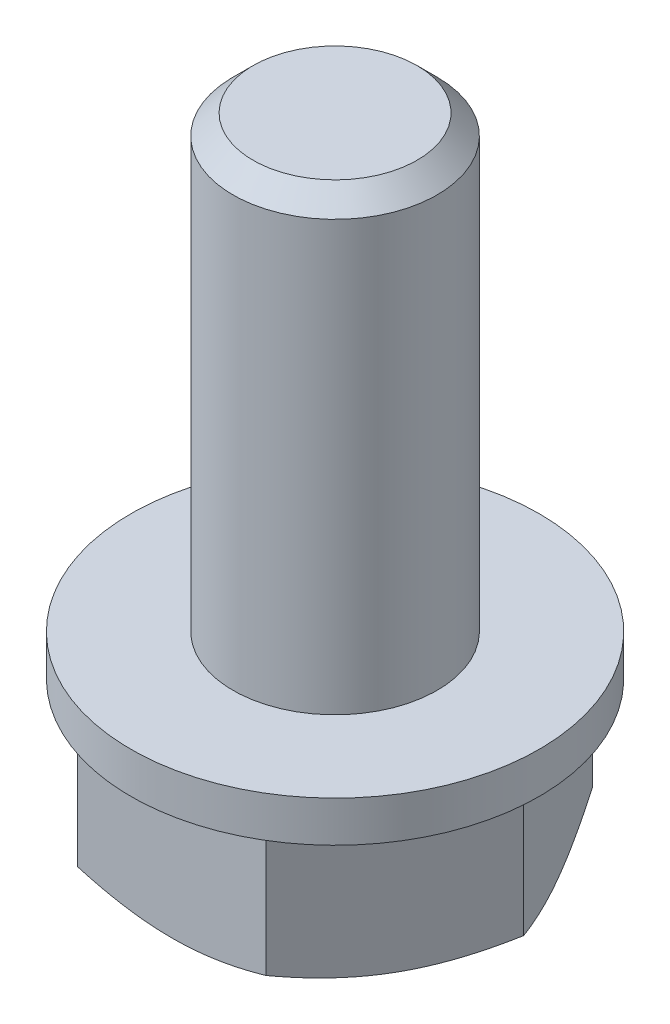
ISO-10303-21;
HEADER;
FILE_DESCRIPTION(('STEP AP214'),'2;1');
FILE_NAME('part.step','',(''),(''),'','','');
FILE_SCHEMA(('AUTOMOTIVE_DESIGN { 1 0 10303 214 1 1 1 1 }'));
ENDSEC;
DATA;
#1=APPLICATION_CONTEXT('core data for automotive mechanical design processes');
#2=APPLICATION_PROTOCOL_DEFINITION('international standard','automotive_design',2000,#1);
#3=PRODUCT_CONTEXT('',#1,'mechanical');
#4=PRODUCT('Part','Part','',(#3));
#5=PRODUCT_RELATED_PRODUCT_CATEGORY('part','',(#4));
#6=PRODUCT_DEFINITION_FORMATION('','',#4);
#7=PRODUCT_DEFINITION_CONTEXT('part definition',#1,'design');
#8=PRODUCT_DEFINITION('design','',#6,#7);
#9=PRODUCT_DEFINITION_SHAPE('','',#8);
#10=(LENGTH_UNIT() NAMED_UNIT(*) SI_UNIT(.MILLI.,.METRE.));
#11=(NAMED_UNIT(*) PLANE_ANGLE_UNIT() SI_UNIT($,.RADIAN.));
#12=(NAMED_UNIT(*) SI_UNIT($,.STERADIAN.) SOLID_ANGLE_UNIT());
#13=UNCERTAINTY_MEASURE_WITH_UNIT(LENGTH_MEASURE(1.E-05),#10,'distance_accuracy_value','');
#14=(GEOMETRIC_REPRESENTATION_CONTEXT(3) GLOBAL_UNCERTAINTY_ASSIGNED_CONTEXT((#13)) GLOBAL_UNIT_ASSIGNED_CONTEXT((#10,
#11,#12)) REPRESENTATION_CONTEXT('',''));
#15=CARTESIAN_POINT('',(0.,0.,0.));
#16=DIRECTION('',(0.,0.,1.));
#17=DIRECTION('',(1.,0.,0.));
#18=AXIS2_PLACEMENT_3D('',#15,#16,#17);
#19=CARTESIAN_POINT('',(-12.374368670765,-45.18,-14.374368670765));
#20=DIRECTION('',(0.,-1.,0.));
#21=DIRECTION('',(0.,0.,-1.));
#22=AXIS2_PLACEMENT_3D('',#19,#20,#21);
#23=PLANE('',#22);
#24=CARTESIAN_POINT('',(-12.374368670765,-45.18,-12.374368670765));
#25=DIRECTION('',(0.,-1.,0.));
#26=DIRECTION('',(0.,0.,-1.));
#27=AXIS2_PLACEMENT_3D('',#24,#25,#26);
#28=CIRCLE('',#27,4.);
#29=CARTESIAN_POINT('',(-12.374368670765,-45.18,-16.374368670765));
#30=VERTEX_POINT('',#29);
#31=CARTESIAN_POINT('',(-8.91026705562725,-45.18,-14.374368670765));
#32=VERTEX_POINT('',#31);
#33=EDGE_CURVE('E164',#30,#32,#28,.T.);
#34=ORIENTED_EDGE('',*,*,#33,.T.);
#35=CARTESIAN_POINT('',(-12.374368670765,-45.18,-12.374368670765));
#36=DIRECTION('',(0.,-1.,0.));
#37=DIRECTION('',(0.,0.,-1.));
#38=AXIS2_PLACEMENT_3D('',#35,#36,#37);
#39=CIRCLE('',#38,4.);
#40=CARTESIAN_POINT('',(-8.91026705562725,-45.18,-10.374368670765));
#41=VERTEX_POINT('',#40);
#42=EDGE_CURVE('E167',#32,#41,#39,.T.);
#43=ORIENTED_EDGE('',*,*,#42,.T.);
#44=CARTESIAN_POINT('',(-12.374368670765,-45.18,-12.374368670765));
#45=DIRECTION('',(0.,-1.,0.));
#46=DIRECTION('',(0.,0.,-1.));
#47=AXIS2_PLACEMENT_3D('',#44,#45,#46);
#48=CIRCLE('',#47,4.);
#49=CARTESIAN_POINT('',(-12.374368670765,-45.18,-8.374368670765));
#50=VERTEX_POINT('',#49);
#51=EDGE_CURVE('E110',#41,#50,#48,.T.);
#52=ORIENTED_EDGE('',*,*,#51,.T.);
#53=CARTESIAN_POINT('',(-12.374368670765,-45.18,-12.374368670765));
#54=DIRECTION('',(0.,-1.,0.));
#55=DIRECTION('',(0.,0.,-1.));
#56=AXIS2_PLACEMENT_3D('',#53,#54,#55);
#57=CIRCLE('',#56,4.);
#58=CARTESIAN_POINT('',(-15.8384702859027,-45.18,-10.374368670765));
#59=VERTEX_POINT('',#58);
#60=EDGE_CURVE('E20',#50,#59,#57,.T.);
#61=ORIENTED_EDGE('',*,*,#60,.T.);
#62=CARTESIAN_POINT('',(-12.374368670765,-45.18,-12.374368670765));
#63=DIRECTION('',(0.,-1.,0.));
#64=DIRECTION('',(0.,0.,-1.));
#65=AXIS2_PLACEMENT_3D('',#62,#63,#64);
#66=CIRCLE('',#65,4.);
#67=CARTESIAN_POINT('',(-15.8384702859027,-45.18,-14.374368670765));
#68=VERTEX_POINT('',#67);
#69=EDGE_CURVE('E127',#59,#68,#66,.T.);
#70=ORIENTED_EDGE('',*,*,#69,.T.);
#71=CARTESIAN_POINT('',(-12.374368670765,-45.18,-12.374368670765));
#72=DIRECTION('',(0.,-1.,0.));
#73=DIRECTION('',(0.,0.,-1.));
#74=AXIS2_PLACEMENT_3D('',#71,#72,#73);
#75=CIRCLE('',#74,4.);
#76=EDGE_CURVE('E75',#68,#30,#75,.T.);
#77=ORIENTED_EDGE('',*,*,#76,.T.);
#78=EDGE_LOOP('',(#34,#43,#52,#61,#70,#77));
#79=FACE_BOUND('',#78,.T.);
#80=ADVANCED_FACE('F16',(#79),#23,.T.);
#81=CARTESIAN_POINT('',(-12.374368670765,-42.6413248654052,-12.374368670765));
#82=DIRECTION('',(0.,1.,0.));
#83=DIRECTION('',(0.,0.,-1.));
#84=AXIS2_PLACEMENT_3D('',#81,#82,#83);
#85=CYLINDRICAL_SURFACE('',#84,5.);
#86=CARTESIAN_POINT('',(-12.374368670765,-40.68,-12.374368670765));
#87=DIRECTION('',(0.,-1.,0.));
#88=DIRECTION('',(0.,0.,-1.));
#89=AXIS2_PLACEMENT_3D('',#86,#87,#88);
#90=CIRCLE('',#89,5.);
#91=CARTESIAN_POINT('',(-12.374368670765,-40.68,-17.374368670765));
#92=VERTEX_POINT('',#91);
#93=EDGE_CURVE('E11',#92,#92,#90,.T.);
#94=ORIENTED_EDGE('',*,*,#93,.T.);
#95=EDGE_LOOP('',(#94));
#96=FACE_BOUND('',#95,.T.);
#97=CARTESIAN_POINT('',(-12.374368670765,-41.68,-12.374368670765));
#98=DIRECTION('',(0.,1.,0.));
#99=DIRECTION('',(0.,0.,-1.));
#100=AXIS2_PLACEMENT_3D('',#97,#98,#99);
#101=CIRCLE('',#100,5.);
#102=CARTESIAN_POINT('',(-12.374368670765,-41.68,-17.374368670765));
#103=VERTEX_POINT('',#102);
#104=EDGE_CURVE('E124',#103,#103,#101,.T.);
#105=ORIENTED_EDGE('',*,*,#104,.T.);
#106=EDGE_LOOP('',(#105));
#107=FACE_BOUND('',#106,.T.);
#108=ADVANCED_FACE('F125',(#96,#107),#85,.T.);
#109=CARTESIAN_POINT('',(-12.374368670765,-40.68,-16.124368670765));
#110=DIRECTION('',(0.,1.,0.));
#111=DIRECTION('',(0.,0.,1.));
#112=AXIS2_PLACEMENT_3D('',#109,#110,#111);
#113=PLANE('',#112);
#114=CARTESIAN_POINT('',(-12.374368670765,-40.68,-12.374368670765));
#115=DIRECTION('',(0.,-1.,0.));
#116=DIRECTION('',(0.,0.,-1.));
#117=AXIS2_PLACEMENT_3D('',#114,#115,#116);
#118=CIRCLE('',#117,2.5);
#119=CARTESIAN_POINT('',(-12.374368670765,-40.68,-14.874368670765));
#120=VERTEX_POINT('',#119);
#121=EDGE_CURVE('E26',#120,#120,#118,.T.);
#122=ORIENTED_EDGE('',*,*,#121,.T.);
#123=EDGE_LOOP('',(#122));
#124=FACE_BOUND('',#123,.T.);
#125=ORIENTED_EDGE('',*,*,#93,.F.);
#126=EDGE_LOOP('',(#125));
#127=FACE_BOUND('',#126,.T.);
#128=ADVANCED_FACE('F280',(#124,#127),#113,.T.);
#129=CARTESIAN_POINT('',(-12.374368670765,-35.42525,-12.374368670765));
#130=DIRECTION('',(0.,1.,0.));
#131=DIRECTION('',(0.,0.,-1.));
#132=AXIS2_PLACEMENT_3D('',#129,#130,#131);
#133=CYLINDRICAL_SURFACE('',#132,2.5);
#134=CARTESIAN_POINT('',(-12.374368670765,-30.1705,-12.374368670765));
#135=DIRECTION('',(0.,-1.,0.));
#136=DIRECTION('',(0.,0.,-1.));
#137=AXIS2_PLACEMENT_3D('',#134,#135,#136);
#138=CIRCLE('',#137,2.5);
#139=CARTESIAN_POINT('',(-12.374368670765,-30.1705,-14.874368670765));
#140=VERTEX_POINT('',#139);
#141=EDGE_CURVE('E204',#140,#140,#138,.T.);
#142=ORIENTED_EDGE('',*,*,#141,.T.);
#143=EDGE_LOOP('',(#142));
#144=FACE_BOUND('',#143,.T.);
#145=ORIENTED_EDGE('',*,*,#121,.F.);
#146=EDGE_LOOP('',(#145));
#147=FACE_BOUND('',#146,.T.);
#148=ADVANCED_FACE('F267',(#144,#147),#133,.T.);
#149=CARTESIAN_POINT('',(-12.374368670765,-29.92525,-12.374368670765));
#150=DIRECTION('',(0.,-1.,0.));
#151=DIRECTION('',(0.,0.,-1.));
#152=AXIS2_PLACEMENT_3D('',#149,#150,#151);
#153=CONICAL_SURFACE('',#152,2.25475,0.785398163397448);
#154=CARTESIAN_POINT('',(-12.374368670765,-29.68,-12.374368670765));
#155=DIRECTION('',(0.,-1.,0.));
#156=DIRECTION('',(0.,0.,-1.));
#157=AXIS2_PLACEMENT_3D('',#154,#155,#156);
#158=CIRCLE('',#157,2.0095);
#159=CARTESIAN_POINT('',(-12.374368670765,-29.68,-14.383868670765));
#160=VERTEX_POINT('',#159);
#161=EDGE_CURVE('E202',#160,#160,#158,.T.);
#162=ORIENTED_EDGE('',*,*,#161,.T.);
#163=EDGE_LOOP('',(#162));
#164=FACE_BOUND('',#163,.T.);
#165=ORIENTED_EDGE('',*,*,#141,.F.);
#166=EDGE_LOOP('',(#165));
#167=FACE_BOUND('',#166,.T.);
#168=ADVANCED_FACE('F18',(#164,#167),#153,.T.);
#169=CARTESIAN_POINT('',(-12.374368670765,-29.68,-13.379118670765));
#170=DIRECTION('',(0.,1.,0.));
#171=DIRECTION('',(0.,0.,1.));
#172=AXIS2_PLACEMENT_3D('',#169,#170,#171);
#173=PLANE('',#172);
#174=ORIENTED_EDGE('',*,*,#161,.F.);
#175=EDGE_LOOP('',(#174));
#176=FACE_BOUND('',#175,.T.);
#177=ADVANCED_FACE('F271',(#176),#173,.T.);
#178=CARTESIAN_POINT('',(-12.374368670765,-44.8913248654052,-12.374368670765));
#179=DIRECTION('',(0.,1.,0.));
#180=DIRECTION('',(0.,0.,-1.));
#181=AXIS2_PLACEMENT_3D('',#178,#179,#180);
#182=CONICAL_SURFACE('',#181,4.5,1.04719755119662);
#183=CARTESIAN_POINT('',(-12.374368670765,-45.18,-8.374368670765));
#184=CARTESIAN_POINT('',(-13.446165440497,-45.18,-8.374368670765));
#185=CARTESIAN_POINT('',(-14.6837697475235,-44.8227344100918,-8.37436867076499));
#186=(BOUNDED_CURVE() B_SPLINE_CURVE(2,(#183,#184,#185),.UNSPECIFIED.,.F.,
.F.) B_SPLINE_CURVE_WITH_KNOTS((3,3),(3.06610202231448,5.50179922142013),
.UNSPECIFIED.) CURVE() GEOMETRIC_REPRESENTATION_ITEM() RATIONAL_B_SPLINE_CURVE((1.,
1.04818815858901,1.01981541864881)) REPRESENTATION_ITEM(''));
#187=CARTESIAN_POINT('',(-14.6837697475235,-44.8227344100919,-8.374368670765));
#188=VERTEX_POINT('',#187);
#189=EDGE_CURVE('E140',#50,#188,#186,.T.);
#190=ORIENTED_EDGE('',*,*,#189,.T.);
#191=CARTESIAN_POINT('',(-14.6837697475235,-44.8227344100918,-8.374368670765));
#192=CARTESIAN_POINT('',(-15.3025719010405,-45.1799999999999,-9.44616544048947));
#193=CARTESIAN_POINT('',(-15.8384702859027,-45.18,-10.374368670765));
#194=(BOUNDED_CURVE() B_SPLINE_CURVE(2,(#191,#192,#193),.UNSPECIFIED.,.F.,
.F.) B_SPLINE_CURVE_WITH_KNOTS((3,3),(0.630404823226759,3.06610202231449),
.UNSPECIFIED.) CURVE() GEOMETRIC_REPRESENTATION_ITEM() RATIONAL_B_SPLINE_CURVE((1.01981541864924,
1.04818815858868,1.)) REPRESENTATION_ITEM(''));
#195=EDGE_CURVE('E130',#188,#59,#194,.T.);
#196=ORIENTED_EDGE('',*,*,#195,.T.);
#197=ORIENTED_EDGE('',*,*,#60,.F.);
#198=EDGE_LOOP('',(#190,#196,#197));
#199=FACE_BOUND('',#198,.T.);
#200=ADVANCED_FACE('F234',(#199),#182,.T.);
#201=CARTESIAN_POINT('',(-12.374368670765,-44.8913248654052,-12.374368670765));
#202=DIRECTION('',(0.,1.,0.));
#203=DIRECTION('',(0.,0.,-1.));
#204=AXIS2_PLACEMENT_3D('',#201,#202,#203);
#205=CONICAL_SURFACE('',#204,4.5,1.04719755119662);
#206=CARTESIAN_POINT('',(-8.91026705562725,-45.18,-10.374368670765));
#207=CARTESIAN_POINT('',(-9.44616544049328,-45.18,-9.44616544048297));
#208=CARTESIAN_POINT('',(-10.0649675940065,-44.8227344100919,-8.37436867076499));
#209=(BOUNDED_CURVE() B_SPLINE_CURVE(2,(#206,#207,#208),.UNSPECIFIED.,.F.,
.F.) B_SPLINE_CURVE_WITH_KNOTS((3,3),(3.06610202231449,5.50179922142015),
.UNSPECIFIED.) CURVE() GEOMETRIC_REPRESENTATION_ITEM() RATIONAL_B_SPLINE_CURVE((1.,
1.04818815858904,1.01981541864882)) REPRESENTATION_ITEM(''));
#210=CARTESIAN_POINT('',(-10.0649675940065,-44.8227344100919,-8.374368670765));
#211=VERTEX_POINT('',#210);
#212=EDGE_CURVE('E182',#41,#211,#209,.T.);
#213=ORIENTED_EDGE('',*,*,#212,.T.);
#214=CARTESIAN_POINT('',(-10.0649675940065,-44.8227344100919,-8.37436867076501));
#215=CARTESIAN_POINT('',(-11.3025719010405,-45.1800000000001,-8.37436867076501));
#216=CARTESIAN_POINT('',(-12.374368670765,-45.18,-8.374368670765));
#217=(BOUNDED_CURVE() B_SPLINE_CURVE(2,(#214,#215,#216),.UNSPECIFIED.,.F.,
.F.) B_SPLINE_CURVE_WITH_KNOTS((3,3),(0.630404823226771,3.06610202231448),
.UNSPECIFIED.) CURVE() GEOMETRIC_REPRESENTATION_ITEM() RATIONAL_B_SPLINE_CURVE((1.01981541864923,
1.04818815858865,1.)) REPRESENTATION_ITEM(''));
#218=EDGE_CURVE('E207',#211,#50,#217,.T.);
#219=ORIENTED_EDGE('',*,*,#218,.T.);
#220=ORIENTED_EDGE('',*,*,#51,.F.);
#221=EDGE_LOOP('',(#213,#219,#220));
#222=FACE_BOUND('',#221,.T.);
#223=ADVANCED_FACE('F316',(#222),#205,.T.);
#224=CARTESIAN_POINT('',(-12.374368670765,-44.8913248654052,-12.374368670765));
#225=DIRECTION('',(0.,1.,0.));
#226=DIRECTION('',(0.,0.,-1.));
#227=AXIS2_PLACEMENT_3D('',#224,#225,#226);
#228=CONICAL_SURFACE('',#227,4.5,1.04719755119662);
#229=CARTESIAN_POINT('',(-8.91026705562725,-45.18,-14.374368670765));
#230=CARTESIAN_POINT('',(-8.37436867076123,-45.18,-13.446165440483));
#231=CARTESIAN_POINT('',(-7.75556651724801,-44.8227344100919,-12.374368670765));
#232=(BOUNDED_CURVE() B_SPLINE_CURVE(2,(#229,#230,#231),.UNSPECIFIED.,.F.,
.F.) B_SPLINE_CURVE_WITH_KNOTS((3,3),(3.06610202231449,5.50179922142014),
.UNSPECIFIED.) CURVE() GEOMETRIC_REPRESENTATION_ITEM() RATIONAL_B_SPLINE_CURVE((1.,
1.04818815858902,1.01981541864881)) REPRESENTATION_ITEM(''));
#233=CARTESIAN_POINT('',(-7.755566517248,-44.8227344100919,-12.374368670765));
#234=VERTEX_POINT('',#233);
#235=EDGE_CURVE('E141',#32,#234,#232,.T.);
#236=ORIENTED_EDGE('',*,*,#235,.T.);
#237=CARTESIAN_POINT('',(-7.755566517248,-44.8227344100919,-12.374368670765));
#238=CARTESIAN_POINT('',(-8.37436867076501,-45.1800000000001,-11.3025719010405));
#239=CARTESIAN_POINT('',(-8.91026705562725,-45.18,-10.374368670765));
#240=(BOUNDED_CURVE() B_SPLINE_CURVE(2,(#237,#238,#239),.UNSPECIFIED.,.F.,
.F.) B_SPLINE_CURVE_WITH_KNOTS((3,3),(0.630404823226775,3.06610202231449),
.UNSPECIFIED.) CURVE() GEOMETRIC_REPRESENTATION_ITEM() RATIONAL_B_SPLINE_CURVE((1.01981541864923,
1.04818815858866,1.)) REPRESENTATION_ITEM(''));
#241=EDGE_CURVE('E103',#234,#41,#240,.T.);
#242=ORIENTED_EDGE('',*,*,#241,.T.);
#243=ORIENTED_EDGE('',*,*,#42,.F.);
#244=EDGE_LOOP('',(#236,#242,#243));
#245=FACE_BOUND('',#244,.T.);
#246=ADVANCED_FACE('F298',(#245),#228,.T.);
#247=CARTESIAN_POINT('',(-12.374368670765,-44.8913248654052,-12.374368670765));
#248=DIRECTION('',(0.,1.,0.));
#249=DIRECTION('',(0.,0.,-1.));
#250=AXIS2_PLACEMENT_3D('',#247,#248,#249);
#251=CONICAL_SURFACE('',#250,4.5,1.04719755119662);
#252=CARTESIAN_POINT('',(-10.0649675940065,-44.8227344100918,-16.374368670765));
#253=CARTESIAN_POINT('',(-9.44616544048951,-45.1799999999999,-15.3025719010405));
#254=CARTESIAN_POINT('',(-8.91026705562725,-45.18,-14.374368670765));
#255=(BOUNDED_CURVE() B_SPLINE_CURVE(2,(#252,#253,#254),.UNSPECIFIED.,.F.,
.F.) B_SPLINE_CURVE_WITH_KNOTS((3,3),(0.630404823226759,3.06610202231449),
.UNSPECIFIED.) CURVE() GEOMETRIC_REPRESENTATION_ITEM() RATIONAL_B_SPLINE_CURVE((1.01981541864924,
1.04818815858868,1.)) REPRESENTATION_ITEM(''));
#256=CARTESIAN_POINT('',(-10.0649675940065,-44.8227344100919,-16.374368670765));
#257=VERTEX_POINT('',#256);
#258=EDGE_CURVE('E189',#257,#32,#255,.T.);
#259=ORIENTED_EDGE('',*,*,#258,.T.);
#260=ORIENTED_EDGE('',*,*,#33,.F.);
#261=CARTESIAN_POINT('',(-12.374368670765,-45.18,-16.374368670765));
#262=CARTESIAN_POINT('',(-11.302571901033,-45.18,-16.374368670765));
#263=CARTESIAN_POINT('',(-10.0649675940065,-44.8227344100918,-16.374368670765));
#264=(BOUNDED_CURVE() B_SPLINE_CURVE(2,(#261,#262,#263),.UNSPECIFIED.,.F.,
.F.) B_SPLINE_CURVE_WITH_KNOTS((3,3),(3.06610202231448,5.50179922142013),
.UNSPECIFIED.) CURVE() GEOMETRIC_REPRESENTATION_ITEM() RATIONAL_B_SPLINE_CURVE((1.,
1.04818815858901,1.01981541864881)) REPRESENTATION_ITEM(''));
#265=EDGE_CURVE('E134',#30,#257,#264,.T.);
#266=ORIENTED_EDGE('',*,*,#265,.T.);
#267=EDGE_LOOP('',(#259,#260,#266));
#268=FACE_BOUND('',#267,.T.);
#269=ADVANCED_FACE('F291',(#268),#251,.T.);
#270=CARTESIAN_POINT('',(-12.374368670765,-44.8913248654052,-12.374368670765));
#271=DIRECTION('',(0.,1.,0.));
#272=DIRECTION('',(0.,0.,-1.));
#273=AXIS2_PLACEMENT_3D('',#270,#271,#272);
#274=CONICAL_SURFACE('',#273,4.5,1.04719755119662);
#275=CARTESIAN_POINT('',(-14.6837697475235,-44.8227344100919,-16.374368670765));
#276=CARTESIAN_POINT('',(-13.4461654404895,-45.1800000000001,-16.374368670765));
#277=CARTESIAN_POINT('',(-12.374368670765,-45.18,-16.374368670765));
#278=(BOUNDED_CURVE() B_SPLINE_CURVE(2,(#275,#276,#277),.UNSPECIFIED.,.F.,
.F.) B_SPLINE_CURVE_WITH_KNOTS((3,3),(0.630404823226771,3.06610202231448),
.UNSPECIFIED.) CURVE() GEOMETRIC_REPRESENTATION_ITEM() RATIONAL_B_SPLINE_CURVE((1.01981541864923,
1.04818815858865,1.)) REPRESENTATION_ITEM(''));
#279=CARTESIAN_POINT('',(-14.6837697475235,-44.8227344100919,-16.374368670765));
#280=VERTEX_POINT('',#279);
#281=EDGE_CURVE('E139',#280,#30,#278,.T.);
#282=ORIENTED_EDGE('',*,*,#281,.T.);
#283=ORIENTED_EDGE('',*,*,#76,.F.);
#284=CARTESIAN_POINT('',(-15.8384702859027,-45.18,-14.374368670765));
#285=CARTESIAN_POINT('',(-15.3025719010368,-45.18,-15.3025719010471));
#286=CARTESIAN_POINT('',(-14.6837697475235,-44.8227344100919,-16.374368670765));
#287=(BOUNDED_CURVE() B_SPLINE_CURVE(2,(#284,#285,#286),.UNSPECIFIED.,.F.,
.F.) B_SPLINE_CURVE_WITH_KNOTS((3,3),(3.06610202231449,5.50179922142015),
.UNSPECIFIED.) CURVE() GEOMETRIC_REPRESENTATION_ITEM() RATIONAL_B_SPLINE_CURVE((1.,
1.04818815858904,1.01981541864882)) REPRESENTATION_ITEM(''));
#288=EDGE_CURVE('E149',#68,#280,#287,.T.);
#289=ORIENTED_EDGE('',*,*,#288,.T.);
#290=EDGE_LOOP('',(#282,#283,#289));
#291=FACE_BOUND('',#290,.T.);
#292=ADVANCED_FACE('F289',(#291),#274,.T.);
#293=CARTESIAN_POINT('',(-12.374368670765,-44.8913248654052,-12.374368670765));
#294=DIRECTION('',(0.,1.,0.));
#295=DIRECTION('',(0.,0.,-1.));
#296=AXIS2_PLACEMENT_3D('',#293,#294,#295);
#297=CONICAL_SURFACE('',#296,4.5,1.04719755119662);
#298=CARTESIAN_POINT('',(-16.993170824282,-44.8227344100919,-12.374368670765));
#299=CARTESIAN_POINT('',(-16.374368670765,-45.1800000000001,-13.4461654404895));
#300=CARTESIAN_POINT('',(-15.8384702859027,-45.18,-14.374368670765));
#301=(BOUNDED_CURVE() B_SPLINE_CURVE(2,(#298,#299,#300),.UNSPECIFIED.,.F.,
.F.) B_SPLINE_CURVE_WITH_KNOTS((3,3),(0.630404823226775,3.06610202231449),
.UNSPECIFIED.) CURVE() GEOMETRIC_REPRESENTATION_ITEM() RATIONAL_B_SPLINE_CURVE((1.01981541864923,
1.04818815858866,1.)) REPRESENTATION_ITEM(''));
#302=CARTESIAN_POINT('',(-16.993170824282,-44.8227344100919,-12.374368670765));
#303=VERTEX_POINT('',#302);
#304=EDGE_CURVE('E156',#303,#68,#301,.T.);
#305=ORIENTED_EDGE('',*,*,#304,.T.);
#306=ORIENTED_EDGE('',*,*,#69,.F.);
#307=CARTESIAN_POINT('',(-15.8384702859027,-45.18,-10.374368670765));
#308=CARTESIAN_POINT('',(-16.3743686707688,-45.18,-11.302571901047));
#309=CARTESIAN_POINT('',(-16.993170824282,-44.8227344100919,-12.374368670765));
#310=(BOUNDED_CURVE() B_SPLINE_CURVE(2,(#307,#308,#309),.UNSPECIFIED.,.F.,
.F.) B_SPLINE_CURVE_WITH_KNOTS((3,3),(3.06610202231449,5.50179922142014),
.UNSPECIFIED.) CURVE() GEOMETRIC_REPRESENTATION_ITEM() RATIONAL_B_SPLINE_CURVE((1.,
1.04818815858902,1.01981541864881)) REPRESENTATION_ITEM(''));
#311=EDGE_CURVE('E83',#59,#303,#310,.T.);
#312=ORIENTED_EDGE('',*,*,#311,.T.);
#313=EDGE_LOOP('',(#305,#306,#312));
#314=FACE_BOUND('',#313,.T.);
#315=ADVANCED_FACE('F243',(#314),#297,.T.);
#316=CARTESIAN_POINT('',(-12.374368670765,-41.68,-12.374368670765));
#317=DIRECTION('',(0.,-1.,0.));
#318=DIRECTION('',(-1.,0.,0.));
#319=AXIS2_PLACEMENT_3D('',#316,#317,#318);
#320=PLANE('',#319);
#321=DIRECTION('',(0.5,0.,-0.866025403784439));
#322=VECTOR('',#321,1.);
#323=CARTESIAN_POINT('',(-7.755566517248,-41.68,-12.374368670765));
#324=LINE('',#323,#322);
#325=CARTESIAN_POINT('',(-10.0649675940065,-41.68,-8.374368670765));
#326=VERTEX_POINT('',#325);
#327=CARTESIAN_POINT('',(-7.755566517248,-41.68,-12.374368670765));
#328=VERTEX_POINT('',#327);
#329=EDGE_CURVE('E174',#326,#328,#324,.T.);
#330=ORIENTED_EDGE('',*,*,#329,.T.);
#331=DIRECTION('',(-0.5,0.,-0.866025403784439));
#332=VECTOR('',#331,1.);
#333=CARTESIAN_POINT('',(-10.0649675940065,-41.68,-16.374368670765));
#334=LINE('',#333,#332);
#335=CARTESIAN_POINT('',(-10.0649675940065,-41.68,-16.374368670765));
#336=VERTEX_POINT('',#335);
#337=EDGE_CURVE('E179',#328,#336,#334,.T.);
#338=ORIENTED_EDGE('',*,*,#337,.T.);
#339=DIRECTION('',(-1.,0.,0.));
#340=VECTOR('',#339,1.);
#341=CARTESIAN_POINT('',(-14.6837697475235,-41.68,-16.374368670765));
#342=LINE('',#341,#340);
#343=CARTESIAN_POINT('',(-14.6837697475235,-41.68,-16.374368670765));
#344=VERTEX_POINT('',#343);
#345=EDGE_CURVE('E157',#336,#344,#342,.T.);
#346=ORIENTED_EDGE('',*,*,#345,.T.);
#347=DIRECTION('',(-0.5,0.,0.866025403784439));
#348=VECTOR('',#347,1.);
#349=CARTESIAN_POINT('',(-16.993170824282,-41.68,-12.374368670765));
#350=LINE('',#349,#348);
#351=CARTESIAN_POINT('',(-16.993170824282,-41.68,-12.374368670765));
#352=VERTEX_POINT('',#351);
#353=EDGE_CURVE('E168',#344,#352,#350,.T.);
#354=ORIENTED_EDGE('',*,*,#353,.T.);
#355=DIRECTION('',(0.5,0.,0.866025403784439));
#356=VECTOR('',#355,1.);
#357=CARTESIAN_POINT('',(-14.6837697475235,-41.68,-8.374368670765));
#358=LINE('',#357,#356);
#359=CARTESIAN_POINT('',(-14.6837697475235,-41.68,-8.374368670765));
#360=VERTEX_POINT('',#359);
#361=EDGE_CURVE('E91',#352,#360,#358,.T.);
#362=ORIENTED_EDGE('',*,*,#361,.T.);
#363=DIRECTION('',(1.,0.,0.));
#364=VECTOR('',#363,1.);
#365=CARTESIAN_POINT('',(-10.0649675940065,-41.68,-8.374368670765));
#366=LINE('',#365,#364);
#367=EDGE_CURVE('E116',#360,#326,#366,.T.);
#368=ORIENTED_EDGE('',*,*,#367,.T.);
#369=EDGE_LOOP('',(#330,#338,#346,#354,#362,#368));
#370=FACE_BOUND('',#369,.T.);
#371=ORIENTED_EDGE('',*,*,#104,.F.);
#372=EDGE_LOOP('',(#371));
#373=FACE_BOUND('',#372,.T.);
#374=ADVANCED_FACE('F296',(#370,#373),#320,.T.);
#375=CARTESIAN_POINT('',(-16.993170824282,-45.18,-12.374368670765));
#376=DIRECTION('',(0.866025403784439,0.,-0.5));
#377=DIRECTION('',(-0.5,0.,-0.866025403784439));
#378=AXIS2_PLACEMENT_3D('',#375,#376,#377);
#379=PLANE('',#378);
#380=ORIENTED_EDGE('',*,*,#311,.F.);
#381=ORIENTED_EDGE('',*,*,#195,.F.);
#382=DIRECTION('',(0.,1.,0.));
#383=VECTOR('',#382,1.);
#384=CARTESIAN_POINT('',(-14.6837697475235,-45.18,-8.374368670765));
#385=LINE('',#384,#383);
#386=EDGE_CURVE('E206',#188,#360,#385,.T.);
#387=ORIENTED_EDGE('',*,*,#386,.T.);
#388=ORIENTED_EDGE('',*,*,#361,.F.);
#389=DIRECTION('',(0.,1.,0.));
#390=VECTOR('',#389,1.);
#391=CARTESIAN_POINT('',(-16.993170824282,-45.18,-12.374368670765));
#392=LINE('',#391,#390);
#393=EDGE_CURVE('E169',#303,#352,#392,.T.);
#394=ORIENTED_EDGE('',*,*,#393,.F.);
#395=EDGE_LOOP('',(#380,#381,#387,#388,#394));
#396=FACE_BOUND('',#395,.T.);
#397=ADVANCED_FACE('F237',(#396),#379,.F.);
#398=CARTESIAN_POINT('',(-14.6837697475235,-45.18,-16.374368670765));
#399=DIRECTION('',(0.866025403784439,0.,0.5));
#400=DIRECTION('',(0.5,0.,-0.866025403784439));
#401=AXIS2_PLACEMENT_3D('',#398,#399,#400);
#402=PLANE('',#401);
#403=ORIENTED_EDGE('',*,*,#288,.F.);
#404=ORIENTED_EDGE('',*,*,#304,.F.);
#405=ORIENTED_EDGE('',*,*,#393,.T.);
#406=ORIENTED_EDGE('',*,*,#353,.F.);
#407=DIRECTION('',(0.,1.,0.));
#408=VECTOR('',#407,1.);
#409=CARTESIAN_POINT('',(-14.6837697475235,-45.18,-16.374368670765));
#410=LINE('',#409,#408);
#411=EDGE_CURVE('E163',#280,#344,#410,.T.);
#412=ORIENTED_EDGE('',*,*,#411,.F.);
#413=EDGE_LOOP('',(#403,#404,#405,#406,#412));
#414=FACE_BOUND('',#413,.T.);
#415=ADVANCED_FACE('F241',(#414),#402,.F.);
#416=CARTESIAN_POINT('',(-10.0649675940065,-45.18,-16.374368670765));
#417=DIRECTION('',(0.,0.,1.));
#418=DIRECTION('',(1.,0.,0.));
#419=AXIS2_PLACEMENT_3D('',#416,#417,#418);
#420=PLANE('',#419);
#421=ORIENTED_EDGE('',*,*,#265,.F.);
#422=ORIENTED_EDGE('',*,*,#281,.F.);
#423=ORIENTED_EDGE('',*,*,#411,.T.);
#424=ORIENTED_EDGE('',*,*,#345,.F.);
#425=DIRECTION('',(0.,1.,0.));
#426=VECTOR('',#425,1.);
#427=CARTESIAN_POINT('',(-10.0649675940065,-45.18,-16.374368670765));
#428=LINE('',#427,#426);
#429=EDGE_CURVE('E186',#257,#336,#428,.T.);
#430=ORIENTED_EDGE('',*,*,#429,.F.);
#431=EDGE_LOOP('',(#421,#422,#423,#424,#430));
#432=FACE_BOUND('',#431,.T.);
#433=ADVANCED_FACE('F306',(#432),#420,.F.);
#434=CARTESIAN_POINT('',(-14.6837697475235,-45.18,-8.374368670765));
#435=DIRECTION('',(0.,0.,-1.));
#436=DIRECTION('',(-1.,0.,0.));
#437=AXIS2_PLACEMENT_3D('',#434,#435,#436);
#438=PLANE('',#437);
#439=ORIENTED_EDGE('',*,*,#218,.F.);
#440=DIRECTION('',(0.,1.,0.));
#441=VECTOR('',#440,1.);
#442=CARTESIAN_POINT('',(-10.0649675940065,-45.18,-8.374368670765));
#443=LINE('',#442,#441);
#444=EDGE_CURVE('E180',#211,#326,#443,.T.);
#445=ORIENTED_EDGE('',*,*,#444,.T.);
#446=ORIENTED_EDGE('',*,*,#367,.F.);
#447=ORIENTED_EDGE('',*,*,#386,.F.);
#448=ORIENTED_EDGE('',*,*,#189,.F.);
#449=EDGE_LOOP('',(#439,#445,#446,#447,#448));
#450=FACE_BOUND('',#449,.T.);
#451=ADVANCED_FACE('F328',(#450),#438,.F.);
#452=CARTESIAN_POINT('',(-10.0649675940065,-45.18,-8.374368670765));
#453=DIRECTION('',(-0.866025403784439,0.,-0.5));
#454=DIRECTION('',(-0.5,0.,0.866025403784439));
#455=AXIS2_PLACEMENT_3D('',#452,#453,#454);
#456=PLANE('',#455);
#457=ORIENTED_EDGE('',*,*,#241,.F.);
#458=DIRECTION('',(0.,1.,0.));
#459=VECTOR('',#458,1.);
#460=CARTESIAN_POINT('',(-7.755566517248,-45.18,-12.374368670765));
#461=LINE('',#460,#459);
#462=EDGE_CURVE('E148',#234,#328,#461,.T.);
#463=ORIENTED_EDGE('',*,*,#462,.T.);
#464=ORIENTED_EDGE('',*,*,#329,.F.);
#465=ORIENTED_EDGE('',*,*,#444,.F.);
#466=ORIENTED_EDGE('',*,*,#212,.F.);
#467=EDGE_LOOP('',(#457,#463,#464,#465,#466));
#468=FACE_BOUND('',#467,.T.);
#469=ADVANCED_FACE('F324',(#468),#456,.F.);
#470=CARTESIAN_POINT('',(-7.755566517248,-45.18,-12.374368670765));
#471=DIRECTION('',(-0.866025403784439,0.,0.5));
#472=DIRECTION('',(0.5,0.,0.866025403784439));
#473=AXIS2_PLACEMENT_3D('',#470,#471,#472);
#474=PLANE('',#473);
#475=ORIENTED_EDGE('',*,*,#258,.F.);
#476=ORIENTED_EDGE('',*,*,#429,.T.);
#477=ORIENTED_EDGE('',*,*,#337,.F.);
#478=ORIENTED_EDGE('',*,*,#462,.F.);
#479=ORIENTED_EDGE('',*,*,#235,.F.);
#480=EDGE_LOOP('',(#475,#476,#477,#478,#479));
#481=FACE_BOUND('',#480,.T.);
#482=ADVANCED_FACE('F312',(#481),#474,.F.);
#483=CLOSED_SHELL('',(#80,#108,#128,#148,#168,#177,#200,#223,#246,#269,#292,#315,#374,#397,#415,
#433,#451,#469,#482));
#484=MANIFOLD_SOLID_BREP('B1',#483);
#485=ADVANCED_BREP_SHAPE_REPRESENTATION('',(#18,#484),#14);
#486=SHAPE_DEFINITION_REPRESENTATION(#9,#485);
ENDSEC;
END-ISO-10303-21;
